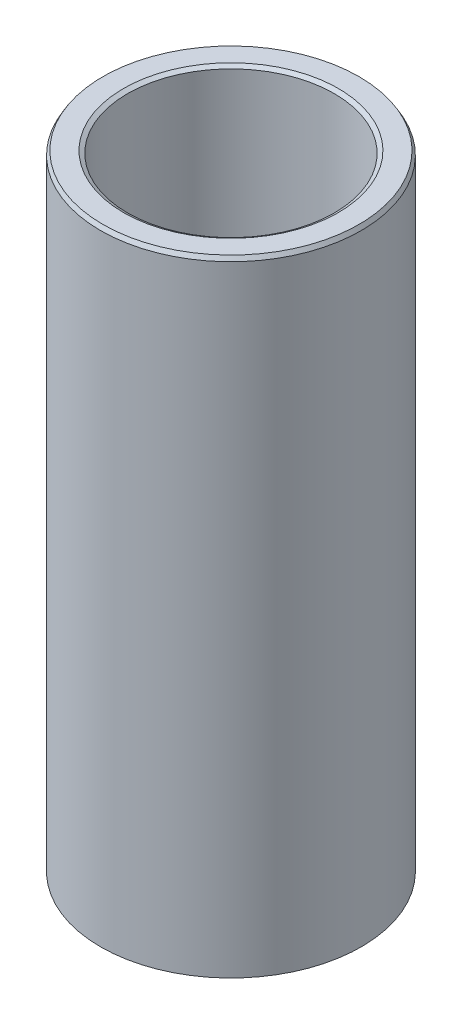
ISO-10303-21;
HEADER;
FILE_DESCRIPTION(('STEP AP214'),'2;1');
FILE_NAME('part.step','',(''),(''),'','','');
FILE_SCHEMA(('AUTOMOTIVE_DESIGN { 1 0 10303 214 1 1 1 1 }'));
ENDSEC;
DATA;
#1=APPLICATION_CONTEXT('core data for automotive mechanical design processes');
#2=APPLICATION_PROTOCOL_DEFINITION('international standard','automotive_design',2000,#1);
#3=PRODUCT_CONTEXT('',#1,'mechanical');
#4=PRODUCT('Part','Part','',(#3));
#5=PRODUCT_RELATED_PRODUCT_CATEGORY('part','',(#4));
#6=PRODUCT_DEFINITION_FORMATION('','',#4);
#7=PRODUCT_DEFINITION_CONTEXT('part definition',#1,'design');
#8=PRODUCT_DEFINITION('design','',#6,#7);
#9=PRODUCT_DEFINITION_SHAPE('','',#8);
#10=(LENGTH_UNIT() NAMED_UNIT(*) SI_UNIT(.MILLI.,.METRE.));
#11=(NAMED_UNIT(*) PLANE_ANGLE_UNIT() SI_UNIT($,.RADIAN.));
#12=(NAMED_UNIT(*) SI_UNIT($,.STERADIAN.) SOLID_ANGLE_UNIT());
#13=UNCERTAINTY_MEASURE_WITH_UNIT(LENGTH_MEASURE(1.E-05),#10,'distance_accuracy_value','');
#14=(GEOMETRIC_REPRESENTATION_CONTEXT(3) GLOBAL_UNCERTAINTY_ASSIGNED_CONTEXT((#13)) GLOBAL_UNIT_ASSIGNED_CONTEXT((#10,
#11,#12)) REPRESENTATION_CONTEXT('',''));
#15=CARTESIAN_POINT('',(0.,0.,0.));
#16=DIRECTION('',(0.,0.,1.));
#17=DIRECTION('',(1.,0.,0.));
#18=AXIS2_PLACEMENT_3D('',#15,#16,#17);
#19=CARTESIAN_POINT('',(0.,192.239043916704,0.));
#20=DIRECTION('',(0.,-1.,0.));
#21=DIRECTION('',(0.,0.,-1.));
#22=AXIS2_PLACEMENT_3D('',#19,#20,#21);
#23=CYLINDRICAL_SURFACE('',#22,40.);
#24=CARTESIAN_POINT('',(0.,0.726219539773337,0.));
#25=DIRECTION('',(0.,1.,0.));
#26=DIRECTION('',(0.,0.,1.));
#27=AXIS2_PLACEMENT_3D('',#24,#25,#26);
#28=CIRCLE('',#27,40.);
#29=CARTESIAN_POINT('',(0.,0.726219539773337,40.));
#30=VERTEX_POINT('',#29);
#31=EDGE_CURVE('E10',#30,#30,#28,.T.);
#32=ORIENTED_EDGE('',*,*,#31,.T.);
#33=EDGE_LOOP('',(#32));
#34=FACE_BOUND('',#33,.T.);
#35=CARTESIAN_POINT('',(0.,190.981194776367,0.));
#36=DIRECTION('',(0.,1.,0.));
#37=DIRECTION('',(0.,0.,1.));
#38=AXIS2_PLACEMENT_3D('',#35,#36,#37);
#39=CIRCLE('',#38,40.);
#40=CARTESIAN_POINT('',(0.,190.981194776367,40.));
#41=VERTEX_POINT('',#40);
#42=EDGE_CURVE('E50',#41,#41,#39,.F.);
#43=ORIENTED_EDGE('',*,*,#42,.T.);
#44=EDGE_LOOP('',(#43));
#45=FACE_BOUND('',#44,.T.);
#46=ADVANCED_FACE('F39',(#34,#45),#23,.T.);
#47=CARTESIAN_POINT('',(0.,192.239043916704,0.));
#48=DIRECTION('',(0.,1.,0.));
#49=DIRECTION('',(0.,0.,1.));
#50=AXIS2_PLACEMENT_3D('',#47,#48,#49);
#51=PLANE('',#50);
#52=CARTESIAN_POINT('',(0.,192.239043916704,0.));
#53=DIRECTION('',(0.,1.,0.));
#54=DIRECTION('',(0.,0.,1.));
#55=AXIS2_PLACEMENT_3D('',#52,#53,#54);
#56=CIRCLE('',#55,32.9641016748367);
#57=CARTESIAN_POINT('',(0.,192.239043916704,32.9641016748367));
#58=VERTEX_POINT('',#57);
#59=EDGE_CURVE('E58',#58,#58,#56,.F.);
#60=ORIENTED_EDGE('',*,*,#59,.T.);
#61=EDGE_LOOP('',(#60));
#62=FACE_BOUND('',#61,.T.);
#63=CARTESIAN_POINT('',(0.,192.239043916704,0.));
#64=DIRECTION('',(0.,1.,0.));
#65=DIRECTION('',(0.,0.,1.));
#66=AXIS2_PLACEMENT_3D('',#63,#64,#65);
#67=CIRCLE('',#66,39.2737804602267);
#68=CARTESIAN_POINT('',(0.,192.239043916704,39.2737804602267));
#69=VERTEX_POINT('',#68);
#70=EDGE_CURVE('E61',#69,#69,#67,.T.);
#71=ORIENTED_EDGE('',*,*,#70,.T.);
#72=EDGE_LOOP('',(#71));
#73=FACE_BOUND('',#72,.T.);
#74=ADVANCED_FACE('F88',(#62,#73),#51,.T.);
#75=CARTESIAN_POINT('',(0.,0.,0.));
#76=DIRECTION('',(0.,1.,0.));
#77=DIRECTION('',(0.,0.,1.));
#78=AXIS2_PLACEMENT_3D('',#75,#76,#77);
#79=PLANE('',#78);
#80=CARTESIAN_POINT('',(0.,0.,0.));
#81=DIRECTION('',(0.,1.,0.));
#82=DIRECTION('',(0.,0.,1.));
#83=AXIS2_PLACEMENT_3D('',#80,#81,#82);
#84=CIRCLE('',#83,32.4324720742733);
#85=CARTESIAN_POINT('',(0.,0.,32.4324720742733));
#86=VERTEX_POINT('',#85);
#87=EDGE_CURVE('E51',#86,#86,#84,.T.);
#88=ORIENTED_EDGE('',*,*,#87,.T.);
#89=EDGE_LOOP('',(#88));
#90=FACE_BOUND('',#89,.T.);
#91=CARTESIAN_POINT('',(0.,0.,0.));
#92=DIRECTION('',(0.,1.,0.));
#93=DIRECTION('',(0.,0.,1.));
#94=AXIS2_PLACEMENT_3D('',#91,#92,#93);
#95=CIRCLE('',#94,38.7421508596633);
#96=CARTESIAN_POINT('',(0.,0.,38.7421508596633));
#97=VERTEX_POINT('',#96);
#98=EDGE_CURVE('E54',#97,#97,#95,.F.);
#99=ORIENTED_EDGE('',*,*,#98,.T.);
#100=EDGE_LOOP('',(#99));
#101=FACE_BOUND('',#100,.T.);
#102=ADVANCED_FACE('F83',(#90,#101),#79,.F.);
#103=CARTESIAN_POINT('',(0.,192.239043916704,0.));
#104=DIRECTION('',(0.,-1.,0.));
#105=DIRECTION('',(0.,0.,-1.));
#106=AXIS2_PLACEMENT_3D('',#103,#104,#105);
#107=CYLINDRICAL_SURFACE('',#106,31.7062525345);
#108=CARTESIAN_POINT('',(0.,191.51282437693,0.));
#109=DIRECTION('',(0.,1.,0.));
#110=DIRECTION('',(0.,0.,1.));
#111=AXIS2_PLACEMENT_3D('',#108,#109,#110);
#112=CIRCLE('',#111,31.7062525345);
#113=CARTESIAN_POINT('',(0.,191.51282437693,31.7062525345));
#114=VERTEX_POINT('',#113);
#115=EDGE_CURVE('E67',#114,#114,#112,.T.);
#116=ORIENTED_EDGE('',*,*,#115,.T.);
#117=EDGE_LOOP('',(#116));
#118=FACE_BOUND('',#117,.T.);
#119=CARTESIAN_POINT('',(0.,1.25784914033672,0.));
#120=DIRECTION('',(0.,1.,0.));
#121=DIRECTION('',(0.,0.,1.));
#122=AXIS2_PLACEMENT_3D('',#119,#120,#121);
#123=CIRCLE('',#122,31.7062525345);
#124=CARTESIAN_POINT('',(0.,1.25784914033672,31.7062525345));
#125=VERTEX_POINT('',#124);
#126=EDGE_CURVE('E69',#125,#125,#123,.F.);
#127=ORIENTED_EDGE('',*,*,#126,.T.);
#128=EDGE_LOOP('',(#127));
#129=FACE_BOUND('',#128,.T.);
#130=ADVANCED_FACE('F71',(#118,#129),#107,.F.);
#131=CARTESIAN_POINT('',(0.,191.51282437693,0.));
#132=DIRECTION('',(0.,1.,0.));
#133=DIRECTION('',(0.,0.,1.));
#134=AXIS2_PLACEMENT_3D('',#131,#132,#133);
#135=CONICAL_SURFACE('',#134,31.7062525345,1.04719755119661);
#136=ORIENTED_EDGE('',*,*,#59,.F.);
#137=EDGE_LOOP('',(#136));
#138=FACE_BOUND('',#137,.T.);
#139=ORIENTED_EDGE('',*,*,#115,.F.);
#140=EDGE_LOOP('',(#139));
#141=FACE_BOUND('',#140,.T.);
#142=ADVANCED_FACE('F77',(#138,#141),#135,.F.);
#143=CARTESIAN_POINT('',(0.,0.,0.));
#144=DIRECTION('',(0.,-1.,0.));
#145=DIRECTION('',(0.,0.,-1.));
#146=AXIS2_PLACEMENT_3D('',#143,#144,#145);
#147=CONICAL_SURFACE('',#146,32.4324720742733,0.523598775598299);
#148=ORIENTED_EDGE('',*,*,#126,.F.);
#149=EDGE_LOOP('',(#148));
#150=FACE_BOUND('',#149,.T.);
#151=ORIENTED_EDGE('',*,*,#87,.F.);
#152=EDGE_LOOP('',(#151));
#153=FACE_BOUND('',#152,.T.);
#154=ADVANCED_FACE('F73',(#150,#153),#147,.F.);
#155=CARTESIAN_POINT('',(0.,0.726219539773337,0.));
#156=DIRECTION('',(0.,1.,0.));
#157=DIRECTION('',(0.,0.,1.));
#158=AXIS2_PLACEMENT_3D('',#155,#156,#157);
#159=CONICAL_SURFACE('',#158,40.,1.0471975511966);
#160=ORIENTED_EDGE('',*,*,#98,.F.);
#161=EDGE_LOOP('',(#160));
#162=FACE_BOUND('',#161,.T.);
#163=ORIENTED_EDGE('',*,*,#31,.F.);
#164=EDGE_LOOP('',(#163));
#165=FACE_BOUND('',#164,.T.);
#166=ADVANCED_FACE('F76',(#162,#165),#159,.T.);
#167=CARTESIAN_POINT('',(0.,192.239043916704,0.));
#168=DIRECTION('',(0.,-1.,0.));
#169=DIRECTION('',(0.,0.,-1.));
#170=AXIS2_PLACEMENT_3D('',#167,#168,#169);
#171=CONICAL_SURFACE('',#170,39.2737804602267,0.523598775598309);
#172=ORIENTED_EDGE('',*,*,#42,.F.);
#173=EDGE_LOOP('',(#172));
#174=FACE_BOUND('',#173,.T.);
#175=ORIENTED_EDGE('',*,*,#70,.F.);
#176=EDGE_LOOP('',(#175));
#177=FACE_BOUND('',#176,.T.);
#178=ADVANCED_FACE('F45',(#174,#177),#171,.T.);
#179=CLOSED_SHELL('',(#46,#74,#102,#130,#142,#154,#166,#178));
#180=MANIFOLD_SOLID_BREP('B2',#179);
#181=ADVANCED_BREP_SHAPE_REPRESENTATION('',(#18,#180),#14);
#182=SHAPE_DEFINITION_REPRESENTATION(#9,#181);
ENDSEC;
END-ISO-10303-21;
